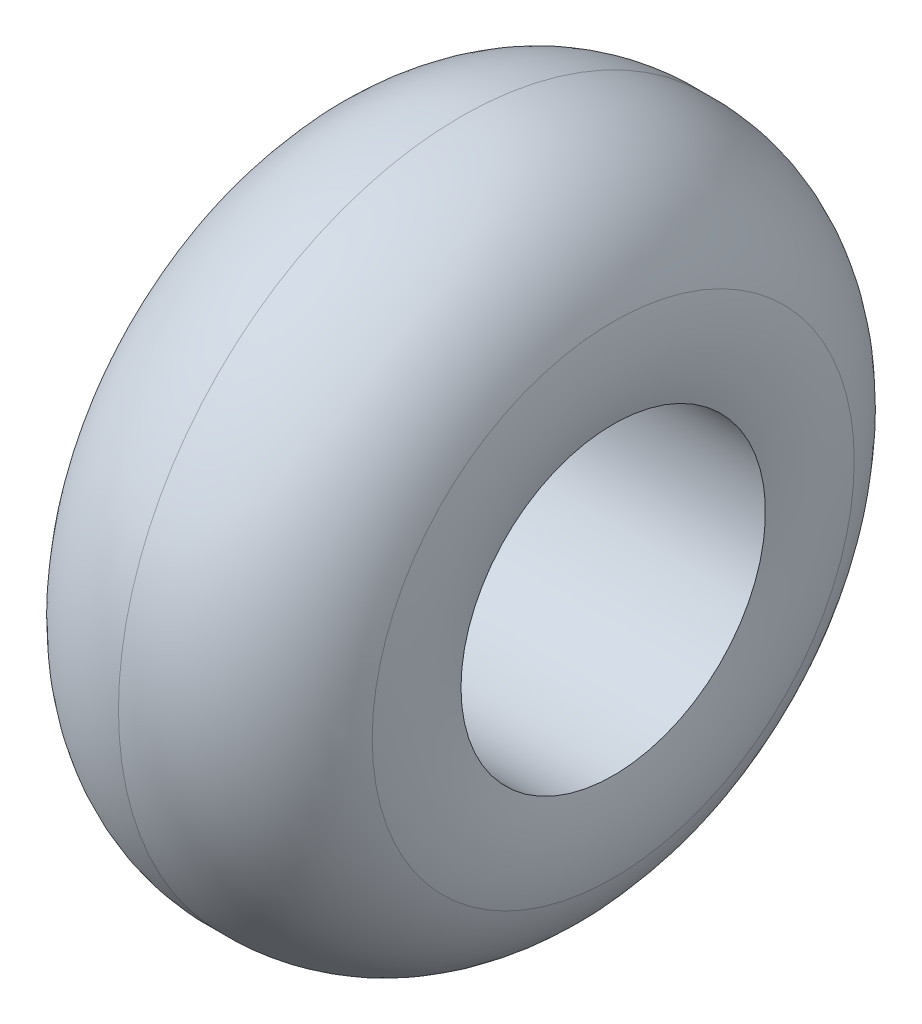
ISO-10303-21;
HEADER;
FILE_DESCRIPTION(('STEP AP214'),'2;1');
FILE_NAME('part.step','',(''),(''),'','','');
FILE_SCHEMA(('AUTOMOTIVE_DESIGN { 1 0 10303 214 1 1 1 1 }'));
ENDSEC;
DATA;
#1=APPLICATION_CONTEXT('core data for automotive mechanical design processes');
#2=APPLICATION_PROTOCOL_DEFINITION('international standard','automotive_design',2000,#1);
#3=PRODUCT_CONTEXT('',#1,'mechanical');
#4=PRODUCT('Part','Part','',(#3));
#5=PRODUCT_RELATED_PRODUCT_CATEGORY('part','',(#4));
#6=PRODUCT_DEFINITION_FORMATION('','',#4);
#7=PRODUCT_DEFINITION_CONTEXT('part definition',#1,'design');
#8=PRODUCT_DEFINITION('design','',#6,#7);
#9=PRODUCT_DEFINITION_SHAPE('','',#8);
#10=(LENGTH_UNIT() NAMED_UNIT(*) SI_UNIT(.MILLI.,.METRE.));
#11=(NAMED_UNIT(*) PLANE_ANGLE_UNIT() SI_UNIT($,.RADIAN.));
#12=(NAMED_UNIT(*) SI_UNIT($,.STERADIAN.) SOLID_ANGLE_UNIT());
#13=UNCERTAINTY_MEASURE_WITH_UNIT(LENGTH_MEASURE(1.E-05),#10,'distance_accuracy_value','');
#14=(GEOMETRIC_REPRESENTATION_CONTEXT(3) GLOBAL_UNCERTAINTY_ASSIGNED_CONTEXT((#13)) GLOBAL_UNIT_ASSIGNED_CONTEXT((#10,
#11,#12)) REPRESENTATION_CONTEXT('',''));
#15=CARTESIAN_POINT('',(0.,0.,0.));
#16=DIRECTION('',(0.,0.,1.));
#17=DIRECTION('',(1.,0.,0.));
#18=AXIS2_PLACEMENT_3D('',#15,#16,#17);
#19=CARTESIAN_POINT('',(-5.87106426173209,0.,0.));
#20=DIRECTION('',(-1.,0.,0.));
#21=DIRECTION('',(0.,0.,1.));
#22=AXIS2_PLACEMENT_3D('',#19,#20,#21);
#23=TOROIDAL_SURFACE('',#22,98.425,85.0271145814872);
#24=CARTESIAN_POINT('',(76.2,0.,0.));
#25=DIRECTION('',(-1.,0.,0.));
#26=DIRECTION('',(0.,0.,1.));
#27=AXIS2_PLACEMENT_3D('',#24,#25,#26);
#28=CIRCLE('',#27,76.2);
#29=CARTESIAN_POINT('',(76.2,0.,76.2));
#30=VERTEX_POINT('',#29);
#31=EDGE_CURVE('E62',#30,#30,#28,.T.);
#32=ORIENTED_EDGE('',*,*,#31,.T.);
#33=EDGE_LOOP('',(#32));
#34=FACE_BOUND('',#33,.T.);
#35=CARTESIAN_POINT('',(76.2,0.,0.));
#36=DIRECTION('',(-1.,0.,0.));
#37=DIRECTION('',(0.,0.,1.));
#38=AXIS2_PLACEMENT_3D('',#35,#36,#37);
#39=CIRCLE('',#38,120.65);
#40=CARTESIAN_POINT('',(76.2,0.,120.65));
#41=VERTEX_POINT('',#40);
#42=EDGE_CURVE('E10',#41,#41,#39,.T.);
#43=ORIENTED_EDGE('',*,*,#42,.F.);
#44=EDGE_LOOP('',(#43));
#45=FACE_BOUND('',#44,.T.);
#46=ADVANCED_FACE('F39',(#34,#45),#23,.T.);
#47=CARTESIAN_POINT('',(4.31484167453225,0.,0.));
#48=DIRECTION('',(-1.,0.,0.));
#49=DIRECTION('',(0.,0.,1.));
#50=AXIS2_PLACEMENT_3D('',#47,#48,#49);
#51=TOROIDAL_SURFACE('',#50,95.3722625117984,76.2);
#52=ORIENTED_EDGE('',*,*,#42,.T.);
#53=EDGE_LOOP('',(#52));
#54=FACE_BOUND('',#53,.T.);
#55=CARTESIAN_POINT('',(0.,0.,0.));
#56=DIRECTION('',(-1.,0.,0.));
#57=DIRECTION('',(0.,0.,1.));
#58=AXIS2_PLACEMENT_3D('',#55,#56,#57);
#59=CIRCLE('',#58,171.45);
#60=CARTESIAN_POINT('',(0.,0.,171.45));
#61=VERTEX_POINT('',#60);
#62=EDGE_CURVE('E46',#61,#61,#59,.T.);
#63=ORIENTED_EDGE('',*,*,#62,.F.);
#64=EDGE_LOOP('',(#63));
#65=FACE_BOUND('',#64,.T.);
#66=ADVANCED_FACE('F83',(#54,#65),#51,.T.);
#67=CARTESIAN_POINT('',(-4.31484167453225,0.,0.));
#68=DIRECTION('',(-1.,0.,0.));
#69=DIRECTION('',(0.,0.,1.));
#70=AXIS2_PLACEMENT_3D('',#67,#68,#69);
#71=TOROIDAL_SURFACE('',#70,95.3722625117984,76.2);
#72=CARTESIAN_POINT('',(-76.2,0.,0.));
#73=DIRECTION('',(-1.,0.,0.));
#74=DIRECTION('',(0.,0.,1.));
#75=AXIS2_PLACEMENT_3D('',#72,#73,#74);
#76=CIRCLE('',#75,120.65);
#77=CARTESIAN_POINT('',(-76.2,0.,120.65));
#78=VERTEX_POINT('',#77);
#79=EDGE_CURVE('E51',#78,#78,#76,.T.);
#80=ORIENTED_EDGE('',*,*,#79,.F.);
#81=EDGE_LOOP('',(#80));
#82=FACE_BOUND('',#81,.T.);
#83=ORIENTED_EDGE('',*,*,#62,.T.);
#84=EDGE_LOOP('',(#83));
#85=FACE_BOUND('',#84,.T.);
#86=ADVANCED_FACE('F78',(#82,#85),#71,.T.);
#87=CARTESIAN_POINT('',(-16.6508667088685,0.,0.));
#88=DIRECTION('',(-1.,0.,0.));
#89=DIRECTION('',(0.,0.,1.));
#90=AXIS2_PLACEMENT_3D('',#87,#88,#89);
#91=TOROIDAL_SURFACE('',#90,98.425,63.5613868691122);
#92=CARTESIAN_POINT('',(-76.2,0.,0.));
#93=DIRECTION('',(-1.,0.,0.));
#94=DIRECTION('',(0.,0.,1.));
#95=AXIS2_PLACEMENT_3D('',#92,#93,#94);
#96=CIRCLE('',#95,76.2);
#97=CARTESIAN_POINT('',(-76.2,0.,76.2));
#98=VERTEX_POINT('',#97);
#99=EDGE_CURVE('E56',#98,#98,#96,.T.);
#100=ORIENTED_EDGE('',*,*,#99,.F.);
#101=EDGE_LOOP('',(#100));
#102=FACE_BOUND('',#101,.T.);
#103=ORIENTED_EDGE('',*,*,#79,.T.);
#104=EDGE_LOOP('',(#103));
#105=FACE_BOUND('',#104,.T.);
#106=ADVANCED_FACE('F72',(#102,#105),#91,.T.);
#107=CARTESIAN_POINT('',(0.,0.,0.));
#108=DIRECTION('',(-1.,0.,0.));
#109=DIRECTION('',(0.,0.,1.));
#110=AXIS2_PLACEMENT_3D('',#107,#108,#109);
#111=CYLINDRICAL_SURFACE('',#110,76.2);
#112=ORIENTED_EDGE('',*,*,#31,.F.);
#113=EDGE_LOOP('',(#112));
#114=FACE_BOUND('',#113,.T.);
#115=ORIENTED_EDGE('',*,*,#99,.T.);
#116=EDGE_LOOP('',(#115));
#117=FACE_BOUND('',#116,.T.);
#118=ADVANCED_FACE('F69',(#114,#117),#111,.F.);
#119=CLOSED_SHELL('',(#46,#66,#86,#106,#118));
#120=MANIFOLD_SOLID_BREP('B2',#119);
#121=ADVANCED_BREP_SHAPE_REPRESENTATION('',(#18,#120),#14);
#122=SHAPE_DEFINITION_REPRESENTATION(#9,#121);
ENDSEC;
END-ISO-10303-21;
